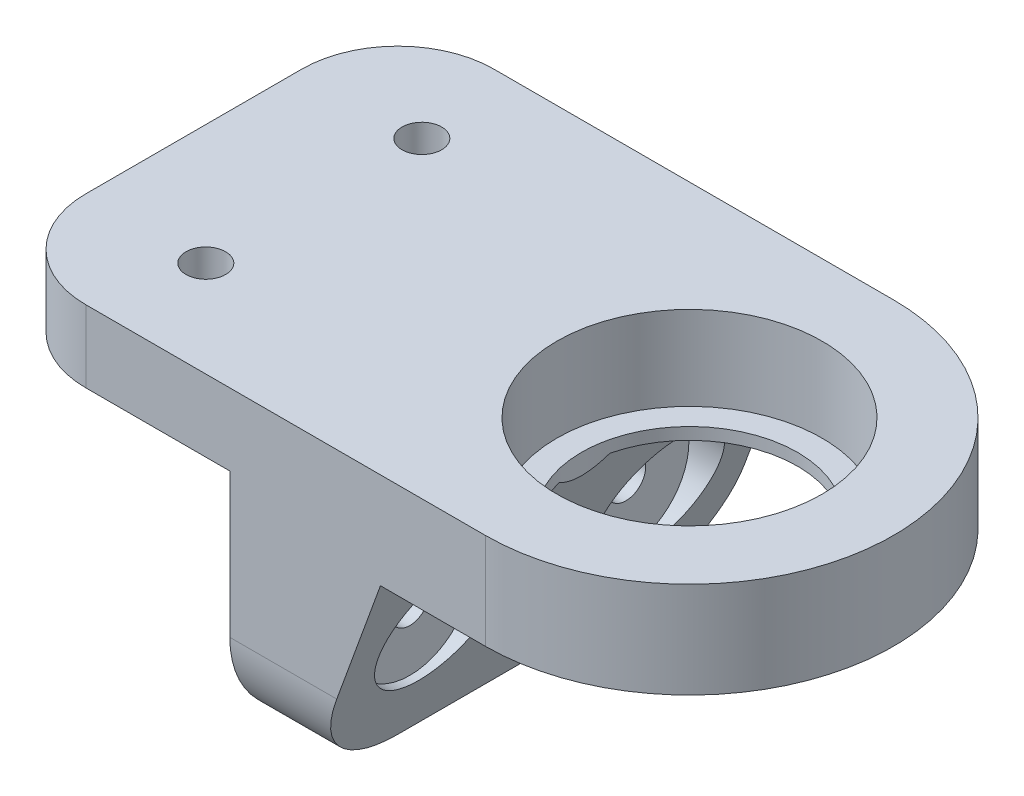
ISO-10303-21;
HEADER;
FILE_DESCRIPTION(('STEP AP214'),'2;1');
FILE_NAME('part.step','',(''),(''),'','','');
FILE_SCHEMA(('AUTOMOTIVE_DESIGN { 1 0 10303 214 1 1 1 1 }'));
ENDSEC;
DATA;
#1=APPLICATION_CONTEXT('core data for automotive mechanical design processes');
#2=APPLICATION_PROTOCOL_DEFINITION('international standard','automotive_design',2000,#1);
#3=PRODUCT_CONTEXT('',#1,'mechanical');
#4=PRODUCT('Part','Part','',(#3));
#5=PRODUCT_RELATED_PRODUCT_CATEGORY('part','',(#4));
#6=PRODUCT_DEFINITION_FORMATION('','',#4);
#7=PRODUCT_DEFINITION_CONTEXT('part definition',#1,'design');
#8=PRODUCT_DEFINITION('design','',#6,#7);
#9=PRODUCT_DEFINITION_SHAPE('','',#8);
#10=(LENGTH_UNIT() NAMED_UNIT(*) SI_UNIT(.MILLI.,.METRE.));
#11=(NAMED_UNIT(*) PLANE_ANGLE_UNIT() SI_UNIT($,.RADIAN.));
#12=(NAMED_UNIT(*) SI_UNIT($,.STERADIAN.) SOLID_ANGLE_UNIT());
#13=UNCERTAINTY_MEASURE_WITH_UNIT(LENGTH_MEASURE(1.E-05),#10,'distance_accuracy_value','');
#14=(GEOMETRIC_REPRESENTATION_CONTEXT(3) GLOBAL_UNCERTAINTY_ASSIGNED_CONTEXT((#13)) GLOBAL_UNIT_ASSIGNED_CONTEXT((#10,
#11,#12)) REPRESENTATION_CONTEXT('',''));
#15=CARTESIAN_POINT('',(0.,0.,0.));
#16=DIRECTION('',(0.,0.,1.));
#17=DIRECTION('',(1.,0.,0.));
#18=AXIS2_PLACEMENT_3D('',#15,#16,#17);
#19=CARTESIAN_POINT('',(-10.,26.,29.));
#20=DIRECTION('',(0.,-1.,0.));
#21=DIRECTION('',(0.,0.,-1.));
#22=AXIS2_PLACEMENT_3D('',#19,#20,#21);
#23=CYLINDRICAL_SURFACE('',#22,1.65);
#24=CARTESIAN_POINT('',(-10.,26.,29.));
#25=DIRECTION('',(0.,-1.,0.));
#26=DIRECTION('',(0.,0.,1.));
#27=AXIS2_PLACEMENT_3D('',#24,#25,#26);
#28=CIRCLE('',#27,1.65);
#29=CARTESIAN_POINT('',(-10.,26.,30.65));
#30=VERTEX_POINT('',#29);
#31=EDGE_CURVE('E210',#30,#30,#28,.T.);
#32=ORIENTED_EDGE('',*,*,#31,.F.);
#33=EDGE_LOOP('',(#32));
#34=FACE_BOUND('',#33,.T.);
#35=CARTESIAN_POINT('',(-10.,21.,29.));
#36=DIRECTION('',(0.,-1.,0.));
#37=DIRECTION('',(0.,0.,-1.));
#38=AXIS2_PLACEMENT_3D('',#35,#36,#37);
#39=CIRCLE('',#38,1.65);
#40=CARTESIAN_POINT('',(-10.,21.,27.35));
#41=VERTEX_POINT('',#40);
#42=EDGE_CURVE('E260',#41,#41,#39,.F.);
#43=ORIENTED_EDGE('',*,*,#42,.F.);
#44=EDGE_LOOP('',(#43));
#45=FACE_BOUND('',#44,.T.);
#46=ADVANCED_FACE('F36',(#34,#45),#23,.F.);
#47=CARTESIAN_POINT('',(-10.,26.,11.));
#48=DIRECTION('',(0.,-1.,0.));
#49=DIRECTION('',(0.,0.,-1.));
#50=AXIS2_PLACEMENT_3D('',#47,#48,#49);
#51=CYLINDRICAL_SURFACE('',#50,1.65);
#52=CARTESIAN_POINT('',(-10.,26.,11.));
#53=DIRECTION('',(0.,-1.,0.));
#54=DIRECTION('',(0.,0.,-1.));
#55=AXIS2_PLACEMENT_3D('',#52,#53,#54);
#56=CIRCLE('',#55,1.65);
#57=CARTESIAN_POINT('',(-10.,26.,9.35));
#58=VERTEX_POINT('',#57);
#59=EDGE_CURVE('E144',#58,#58,#56,.T.);
#60=ORIENTED_EDGE('',*,*,#59,.F.);
#61=EDGE_LOOP('',(#60));
#62=FACE_BOUND('',#61,.T.);
#63=CARTESIAN_POINT('',(-10.,21.,11.));
#64=DIRECTION('',(0.,-1.,0.));
#65=DIRECTION('',(0.,0.,-1.));
#66=AXIS2_PLACEMENT_3D('',#63,#64,#65);
#67=CIRCLE('',#66,1.65);
#68=CARTESIAN_POINT('',(-10.,21.,9.35));
#69=VERTEX_POINT('',#68);
#70=EDGE_CURVE('E256',#69,#69,#67,.F.);
#71=ORIENTED_EDGE('',*,*,#70,.F.);
#72=EDGE_LOOP('',(#71));
#73=FACE_BOUND('',#72,.T.);
#74=ADVANCED_FACE('F305',(#62,#73),#51,.F.);
#75=CARTESIAN_POINT('',(38.3,10.,11.));
#76=DIRECTION('',(-1.,0.,0.));
#77=DIRECTION('',(0.,-1.,0.));
#78=AXIS2_PLACEMENT_3D('',#75,#76,#77);
#79=CYLINDRICAL_SURFACE('',#78,1.65);
#80=CARTESIAN_POINT('',(1.,10.,11.));
#81=DIRECTION('',(1.,0.,0.));
#82=DIRECTION('',(0.,0.,-1.));
#83=AXIS2_PLACEMENT_3D('',#80,#81,#82);
#84=CIRCLE('',#83,1.65);
#85=CARTESIAN_POINT('',(1.,10.,9.35));
#86=VERTEX_POINT('',#85);
#87=EDGE_CURVE('E40',#86,#86,#84,.F.);
#88=ORIENTED_EDGE('',*,*,#87,.T.);
#89=EDGE_LOOP('',(#88));
#90=FACE_BOUND('',#89,.T.);
#91=CARTESIAN_POINT('',(7.,10.,11.));
#92=DIRECTION('',(1.,0.,0.));
#93=DIRECTION('',(0.,0.,-1.));
#94=AXIS2_PLACEMENT_3D('',#91,#92,#93);
#95=CIRCLE('',#94,1.65);
#96=CARTESIAN_POINT('',(7.,10.,9.35));
#97=VERTEX_POINT('',#96);
#98=EDGE_CURVE('E220',#97,#97,#95,.F.);
#99=ORIENTED_EDGE('',*,*,#98,.F.);
#100=EDGE_LOOP('',(#99));
#101=FACE_BOUND('',#100,.T.);
#102=ADVANCED_FACE('F357',(#90,#101),#79,.F.);
#103=CARTESIAN_POINT('',(38.3,10.,29.));
#104=DIRECTION('',(-1.,0.,0.));
#105=DIRECTION('',(0.,-1.,0.));
#106=AXIS2_PLACEMENT_3D('',#103,#104,#105);
#107=CYLINDRICAL_SURFACE('',#106,1.65);
#108=CARTESIAN_POINT('',(1.,10.,29.));
#109=DIRECTION('',(1.,0.,0.));
#110=DIRECTION('',(0.,0.,-1.));
#111=AXIS2_PLACEMENT_3D('',#108,#109,#110);
#112=CIRCLE('',#111,1.65);
#113=CARTESIAN_POINT('',(1.,10.,27.35));
#114=VERTEX_POINT('',#113);
#115=EDGE_CURVE('E264',#114,#114,#112,.F.);
#116=ORIENTED_EDGE('',*,*,#115,.T.);
#117=EDGE_LOOP('',(#116));
#118=FACE_BOUND('',#117,.T.);
#119=CARTESIAN_POINT('',(7.,10.,29.));
#120=DIRECTION('',(1.,0.,0.));
#121=DIRECTION('',(0.,0.,-1.));
#122=AXIS2_PLACEMENT_3D('',#119,#120,#121);
#123=CIRCLE('',#122,1.65);
#124=CARTESIAN_POINT('',(7.,10.,27.35));
#125=VERTEX_POINT('',#124);
#126=EDGE_CURVE('E212',#125,#125,#123,.F.);
#127=ORIENTED_EDGE('',*,*,#126,.F.);
#128=EDGE_LOOP('',(#127));
#129=FACE_BOUND('',#128,.T.);
#130=ADVANCED_FACE('F360',(#118,#129),#107,.F.);
#131=CARTESIAN_POINT('',(21.3,26.,20.));
#132=DIRECTION('',(0.,-1.,0.));
#133=DIRECTION('',(0.,0.,-1.));
#134=AXIS2_PLACEMENT_3D('',#131,#132,#133);
#135=CYLINDRICAL_SURFACE('',#134,9.00000000000001);
#136=CARTESIAN_POINT('',(21.3,18.,20.));
#137=DIRECTION('',(0.,1.,0.));
#138=DIRECTION('',(0.,0.,1.));
#139=AXIS2_PLACEMENT_3D('',#136,#137,#138);
#140=CIRCLE('',#139,9.00000000000001);
#141=CARTESIAN_POINT('',(12.5514642167915,18.,22.1126101509557));
#142=VERTEX_POINT('',#141);
#143=CARTESIAN_POINT('',(12.5514642167915,18.,17.8873898490444));
#144=VERTEX_POINT('',#143);
#145=EDGE_CURVE('E179',#142,#144,#140,.T.);
#146=ORIENTED_EDGE('',*,*,#145,.F.);
#147=CARTESIAN_POINT('',(21.3,42.0364045176566,20.));
#148=DIRECTION('',(-0.939692620785911,0.342020143325663,0.));
#149=DIRECTION('',(-0.342020143325663,-0.939692620785911,0.));
#150=AXIS2_PLACEMENT_3D('',#147,#148,#149);
#151=ELLIPSE('',#150,26.3142396014683,9.00000000000001);
#152=EDGE_CURVE('E182',#144,#142,#151,.T.);
#153=ORIENTED_EDGE('',*,*,#152,.F.);
#154=EDGE_LOOP('',(#146,#153));
#155=FACE_BOUND('',#154,.T.);
#156=CARTESIAN_POINT('',(21.3,19.,20.));
#157=DIRECTION('',(0.,1.,0.));
#158=DIRECTION('',(-1.,0.,0.));
#159=AXIS2_PLACEMENT_3D('',#156,#157,#158);
#160=CIRCLE('',#159,9.00000000000001);
#161=CARTESIAN_POINT('',(12.3,19.,20.));
#162=VERTEX_POINT('',#161);
#163=EDGE_CURVE('E207',#162,#162,#160,.F.);
#164=ORIENTED_EDGE('',*,*,#163,.F.);
#165=EDGE_LOOP('',(#164));
#166=FACE_BOUND('',#165,.T.);
#167=ADVANCED_FACE('F364',(#155,#166),#135,.F.);
#168=CARTESIAN_POINT('',(0.,20.,40.));
#169=DIRECTION('',(1.,0.,0.));
#170=DIRECTION('',(0.,1.,0.));
#171=AXIS2_PLACEMENT_3D('',#168,#169,#170);
#172=PLANE('',#171);
#173=CARTESIAN_POINT('',(0.,10.,11.));
#174=DIRECTION('',(1.,0.,0.));
#175=DIRECTION('',(0.,0.,-1.));
#176=AXIS2_PLACEMENT_3D('',#173,#174,#175);
#177=CIRCLE('',#176,5.25);
#178=CARTESIAN_POINT('',(0.,10.,5.75000000000001));
#179=VERTEX_POINT('',#178);
#180=EDGE_CURVE('E280',#179,#179,#177,.T.);
#181=ORIENTED_EDGE('',*,*,#180,.T.);
#182=EDGE_LOOP('',(#181));
#183=FACE_BOUND('',#182,.T.);
#184=CARTESIAN_POINT('',(0.,10.,29.));
#185=DIRECTION('',(1.,0.,0.));
#186=DIRECTION('',(0.,0.,-1.));
#187=AXIS2_PLACEMENT_3D('',#184,#185,#186);
#188=CIRCLE('',#187,5.25);
#189=CARTESIAN_POINT('',(0.,10.,23.75));
#190=VERTEX_POINT('',#189);
#191=EDGE_CURVE('E273',#190,#190,#188,.T.);
#192=ORIENTED_EDGE('',*,*,#191,.T.);
#193=EDGE_LOOP('',(#192));
#194=FACE_BOUND('',#193,.T.);
#195=DIRECTION('',(0.,-1.,0.));
#196=VECTOR('',#195,1.);
#197=CARTESIAN_POINT('',(0.,20.,2.99999999999999));
#198=LINE('',#197,#196);
#199=CARTESIAN_POINT('',(0.,20.,2.99999999999999));
#200=VERTEX_POINT('',#199);
#201=CARTESIAN_POINT('',(0.,8.,2.99999999999999));
#202=VERTEX_POINT('',#201);
#203=EDGE_CURVE('E169',#200,#202,#198,.T.);
#204=ORIENTED_EDGE('',*,*,#203,.T.);
#205=CARTESIAN_POINT('',(0.,8.,11.));
#206=DIRECTION('',(1.,0.,0.));
#207=DIRECTION('',(0.,1.,0.));
#208=AXIS2_PLACEMENT_3D('',#205,#206,#207);
#209=CIRCLE('',#208,8.);
#210=CARTESIAN_POINT('',(0.,0.,11.));
#211=VERTEX_POINT('',#210);
#212=EDGE_CURVE('E250',#202,#211,#209,.F.);
#213=ORIENTED_EDGE('',*,*,#212,.T.);
#214=DIRECTION('',(0.,0.,-1.));
#215=VECTOR('',#214,1.);
#216=CARTESIAN_POINT('',(0.,0.,40.));
#217=LINE('',#216,#215);
#218=CARTESIAN_POINT('',(0.,0.,29.));
#219=VERTEX_POINT('',#218);
#220=EDGE_CURVE('E199',#219,#211,#217,.T.);
#221=ORIENTED_EDGE('',*,*,#220,.F.);
#222=CARTESIAN_POINT('',(0.,8.,29.));
#223=DIRECTION('',(1.,0.,0.));
#224=DIRECTION('',(0.,1.,0.));
#225=AXIS2_PLACEMENT_3D('',#222,#223,#224);
#226=CIRCLE('',#225,8.);
#227=CARTESIAN_POINT('',(0.,8.,37.));
#228=VERTEX_POINT('',#227);
#229=EDGE_CURVE('E248',#219,#228,#226,.F.);
#230=ORIENTED_EDGE('',*,*,#229,.T.);
#231=DIRECTION('',(0.,1.,0.));
#232=VECTOR('',#231,1.);
#233=CARTESIAN_POINT('',(0.,20.,37.));
#234=LINE('',#233,#232);
#235=CARTESIAN_POINT('',(0.,20.,37.));
#236=VERTEX_POINT('',#235);
#237=EDGE_CURVE('E163',#228,#236,#234,.T.);
#238=ORIENTED_EDGE('',*,*,#237,.T.);
#239=DIRECTION('',(0.,0.,-1.));
#240=VECTOR('',#239,1.);
#241=CARTESIAN_POINT('',(0.,20.,40.));
#242=LINE('',#241,#240);
#243=EDGE_CURVE('E185',#236,#200,#242,.T.);
#244=ORIENTED_EDGE('',*,*,#243,.T.);
#245=EDGE_LOOP('',(#204,#213,#221,#230,#238,#244));
#246=FACE_BOUND('',#245,.T.);
#247=ADVANCED_FACE('F379',(#183,#194,#246),#172,.F.);
#248=CARTESIAN_POINT('',(0.,0.,40.));
#249=DIRECTION('',(0.,1.,0.));
#250=DIRECTION('',(0.,0.,1.));
#251=AXIS2_PLACEMENT_3D('',#248,#249,#250);
#252=PLANE('',#251);
#253=ORIENTED_EDGE('',*,*,#220,.T.);
#254=DIRECTION('',(-1.,0.,0.));
#255=VECTOR('',#254,1.);
#256=CARTESIAN_POINT('',(0.,0.,11.));
#257=LINE('',#256,#255);
#258=CARTESIAN_POINT('',(6.,0.,11.));
#259=VERTEX_POINT('',#258);
#260=EDGE_CURVE('E53',#211,#259,#257,.F.);
#261=ORIENTED_EDGE('',*,*,#260,.T.);
#262=DIRECTION('',(0.,0.,-1.));
#263=VECTOR('',#262,1.);
#264=CARTESIAN_POINT('',(6.,0.,40.));
#265=LINE('',#264,#263);
#266=CARTESIAN_POINT('',(6.,0.,29.));
#267=VERTEX_POINT('',#266);
#268=EDGE_CURVE('E197',#267,#259,#265,.T.);
#269=ORIENTED_EDGE('',*,*,#268,.F.);
#270=DIRECTION('',(1.,0.,0.));
#271=VECTOR('',#270,1.);
#272=CARTESIAN_POINT('',(0.,0.,29.));
#273=LINE('',#272,#271);
#274=EDGE_CURVE('E252',#267,#219,#273,.F.);
#275=ORIENTED_EDGE('',*,*,#274,.T.);
#276=EDGE_LOOP('',(#253,#261,#269,#275));
#277=FACE_BOUND('',#276,.T.);
#278=ADVANCED_FACE('F398',(#277),#252,.F.);
#279=CARTESIAN_POINT('',(6.,0.,40.));
#280=DIRECTION('',(-0.939692620785911,0.342020143325663,0.));
#281=DIRECTION('',(-0.342020143325663,-0.939692620785911,0.));
#282=AXIS2_PLACEMENT_3D('',#279,#280,#281);
#283=PLANE('',#282);
#284=CARTESIAN_POINT('',(9.63970234266195,10.,11.));
#285=DIRECTION('',(-0.939692620785911,0.342020143325663,0.));
#286=DIRECTION('',(-0.342020143325663,-0.939692620785911,0.));
#287=AXIS2_PLACEMENT_3D('',#284,#285,#286);
#288=ELLIPSE('',#287,5.58693330549853,5.25);
#289=CARTESIAN_POINT('',(7.72885861276443,4.75,11.));
#290=VERTEX_POINT('',#289);
#291=EDGE_CURVE('E223',#290,#290,#288,.F.);
#292=ORIENTED_EDGE('',*,*,#291,.F.);
#293=EDGE_LOOP('',(#292));
#294=FACE_BOUND('',#293,.T.);
#295=CARTESIAN_POINT('',(9.63970234266195,10.,29.));
#296=DIRECTION('',(-0.939692620785911,0.342020143325663,0.));
#297=DIRECTION('',(-0.342020143325663,-0.939692620785911,0.));
#298=AXIS2_PLACEMENT_3D('',#295,#296,#297);
#299=ELLIPSE('',#298,5.58693330549853,5.25);
#300=CARTESIAN_POINT('',(7.72885861276443,4.75,29.));
#301=VERTEX_POINT('',#300);
#302=EDGE_CURVE('E215',#301,#301,#299,.F.);
#303=ORIENTED_EDGE('',*,*,#302,.F.);
#304=EDGE_LOOP('',(#303));
#305=FACE_BOUND('',#304,.T.);
#306=ORIENTED_EDGE('',*,*,#268,.T.);
#307=CARTESIAN_POINT('',(8.91176187412956,8.,11.));
#308=DIRECTION('',(-0.939692620785911,0.342020143325663,0.));
#309=DIRECTION('',(-0.342020143325663,-0.939692620785911,0.));
#310=AXIS2_PLACEMENT_3D('',#307,#308,#309);
#311=ELLIPSE('',#310,8.51342217980728,8.);
#312=CARTESIAN_POINT('',(8.91176187412956,8.,3.));
#313=VERTEX_POINT('',#312);
#314=EDGE_CURVE('E11',#259,#313,#311,.F.);
#315=ORIENTED_EDGE('',*,*,#314,.T.);
#316=DIRECTION('',(0.342020143325663,0.939692620785911,0.));
#317=VECTOR('',#316,1.);
#318=CARTESIAN_POINT('',(6.,0.,3.));
#319=LINE('',#318,#317);
#320=CARTESIAN_POINT('',(12.5514642167915,18.,3.));
#321=VERTEX_POINT('',#320);
#322=EDGE_CURVE('E175',#313,#321,#319,.T.);
#323=ORIENTED_EDGE('',*,*,#322,.T.);
#324=DIRECTION('',(0.,0.,-1.));
#325=VECTOR('',#324,1.);
#326=CARTESIAN_POINT('',(12.5514642167915,18.,40.));
#327=LINE('',#326,#325);
#328=EDGE_CURVE('E194',#144,#321,#327,.T.);
#329=ORIENTED_EDGE('',*,*,#328,.F.);
#330=ORIENTED_EDGE('',*,*,#152,.T.);
#331=CARTESIAN_POINT('',(12.5514642167915,18.,37.));
#332=VERTEX_POINT('',#331);
#333=EDGE_CURVE('E195',#332,#142,#327,.T.);
#334=ORIENTED_EDGE('',*,*,#333,.F.);
#335=DIRECTION('',(-0.342020143325663,-0.939692620785911,0.));
#336=VECTOR('',#335,1.);
#337=CARTESIAN_POINT('',(6.,0.,37.));
#338=LINE('',#337,#336);
#339=CARTESIAN_POINT('',(8.91176187412956,8.,37.));
#340=VERTEX_POINT('',#339);
#341=EDGE_CURVE('E167',#332,#340,#338,.T.);
#342=ORIENTED_EDGE('',*,*,#341,.T.);
#343=CARTESIAN_POINT('',(8.91176187412956,8.,29.));
#344=DIRECTION('',(-0.939692620785911,0.342020143325663,0.));
#345=DIRECTION('',(0.342020143325663,0.939692620785911,0.));
#346=AXIS2_PLACEMENT_3D('',#343,#344,#345);
#347=ELLIPSE('',#346,8.51342217980728,8.);
#348=EDGE_CURVE('E45',#340,#267,#347,.F.);
#349=ORIENTED_EDGE('',*,*,#348,.T.);
#350=EDGE_LOOP('',(#306,#315,#323,#329,#330,#334,#342,#349));
#351=FACE_BOUND('',#350,.T.);
#352=ADVANCED_FACE('F394',(#294,#305,#351),#283,.F.);
#353=CARTESIAN_POINT('',(12.5514642167915,18.,40.));
#354=DIRECTION('',(0.,1.,0.));
#355=DIRECTION('',(0.,0.,1.));
#356=AXIS2_PLACEMENT_3D('',#353,#354,#355);
#357=PLANE('',#356);
#358=ORIENTED_EDGE('',*,*,#328,.T.);
#359=DIRECTION('',(1.,0.,0.));
#360=VECTOR('',#359,1.);
#361=CARTESIAN_POINT('',(12.5514642167915,18.,3.));
#362=LINE('',#361,#360);
#363=CARTESIAN_POINT('',(21.3,18.,3.));
#364=VERTEX_POINT('',#363);
#365=EDGE_CURVE('E172',#321,#364,#362,.T.);
#366=ORIENTED_EDGE('',*,*,#365,.T.);
#367=CARTESIAN_POINT('',(21.3,18.,20.));
#368=DIRECTION('',(0.,1.,0.));
#369=DIRECTION('',(0.,0.,1.));
#370=AXIS2_PLACEMENT_3D('',#367,#368,#369);
#371=CIRCLE('',#370,17.);
#372=CARTESIAN_POINT('',(21.3,18.,37.));
#373=VERTEX_POINT('',#372);
#374=EDGE_CURVE('E177',#364,#373,#371,.F.);
#375=ORIENTED_EDGE('',*,*,#374,.T.);
#376=DIRECTION('',(-1.,0.,0.));
#377=VECTOR('',#376,1.);
#378=CARTESIAN_POINT('',(12.5514642167915,18.,37.));
#379=LINE('',#378,#377);
#380=EDGE_CURVE('E150',#373,#332,#379,.T.);
#381=ORIENTED_EDGE('',*,*,#380,.T.);
#382=ORIENTED_EDGE('',*,*,#333,.T.);
#383=ORIENTED_EDGE('',*,*,#145,.T.);
#384=EDGE_LOOP('',(#358,#366,#375,#381,#382,#383));
#385=FACE_BOUND('',#384,.T.);
#386=ADVANCED_FACE('F390',(#385),#357,.F.);
#387=CARTESIAN_POINT('',(49.,26.,40.));
#388=DIRECTION('',(0.,-1.,0.));
#389=DIRECTION('',(1.,0.,0.));
#390=AXIS2_PLACEMENT_3D('',#387,#388,#389);
#391=PLANE('',#390);
#392=CARTESIAN_POINT('',(21.3,26.,20.));
#393=DIRECTION('',(0.,1.,0.));
#394=DIRECTION('',(-1.,0.,0.));
#395=AXIS2_PLACEMENT_3D('',#392,#393,#394);
#396=CIRCLE('',#395,11.05);
#397=CARTESIAN_POINT('',(10.25,26.,20.));
#398=VERTEX_POINT('',#397);
#399=EDGE_CURVE('E219',#398,#398,#396,.T.);
#400=ORIENTED_EDGE('',*,*,#399,.F.);
#401=EDGE_LOOP('',(#400));
#402=FACE_BOUND('',#401,.T.);
#403=ORIENTED_EDGE('',*,*,#31,.T.);
#404=EDGE_LOOP('',(#403));
#405=FACE_BOUND('',#404,.T.);
#406=ORIENTED_EDGE('',*,*,#59,.T.);
#407=EDGE_LOOP('',(#406));
#408=FACE_BOUND('',#407,.T.);
#409=DIRECTION('',(0.,0.,-1.));
#410=VECTOR('',#409,1.);
#411=CARTESIAN_POINT('',(-20.,26.,40.));
#412=LINE('',#411,#410);
#413=CARTESIAN_POINT('',(-20.,26.,29.));
#414=VERTEX_POINT('',#413);
#415=CARTESIAN_POINT('',(-20.,26.,11.));
#416=VERTEX_POINT('',#415);
#417=EDGE_CURVE('E191',#414,#416,#412,.T.);
#418=ORIENTED_EDGE('',*,*,#417,.F.);
#419=CARTESIAN_POINT('',(-12.,26.,29.));
#420=DIRECTION('',(0.,-1.,0.));
#421=DIRECTION('',(1.,0.,0.));
#422=AXIS2_PLACEMENT_3D('',#419,#420,#421);
#423=CIRCLE('',#422,8.);
#424=CARTESIAN_POINT('',(-12.,26.,37.));
#425=VERTEX_POINT('',#424);
#426=EDGE_CURVE('E140',#414,#425,#423,.F.);
#427=ORIENTED_EDGE('',*,*,#426,.T.);
#428=DIRECTION('',(1.,0.,0.));
#429=VECTOR('',#428,1.);
#430=CARTESIAN_POINT('',(-20.,26.,37.));
#431=LINE('',#430,#429);
#432=CARTESIAN_POINT('',(21.3,26.,37.));
#433=VERTEX_POINT('',#432);
#434=EDGE_CURVE('E132',#425,#433,#431,.T.);
#435=ORIENTED_EDGE('',*,*,#434,.T.);
#436=CARTESIAN_POINT('',(21.3,26.,20.));
#437=DIRECTION('',(0.,1.,0.));
#438=DIRECTION('',(0.,0.,-1.));
#439=AXIS2_PLACEMENT_3D('',#436,#437,#438);
#440=CIRCLE('',#439,17.);
#441=CARTESIAN_POINT('',(21.3,26.,3.));
#442=VERTEX_POINT('',#441);
#443=EDGE_CURVE('E138',#433,#442,#440,.T.);
#444=ORIENTED_EDGE('',*,*,#443,.T.);
#445=DIRECTION('',(-1.,0.,0.));
#446=VECTOR('',#445,1.);
#447=CARTESIAN_POINT('',(21.3,26.,3.));
#448=LINE('',#447,#446);
#449=CARTESIAN_POINT('',(-12.,26.,2.99999999999999));
#450=VERTEX_POINT('',#449);
#451=EDGE_CURVE('E154',#442,#450,#448,.T.);
#452=ORIENTED_EDGE('',*,*,#451,.T.);
#453=CARTESIAN_POINT('',(-12.,26.,11.));
#454=DIRECTION('',(0.,-1.,0.));
#455=DIRECTION('',(1.,0.,0.));
#456=AXIS2_PLACEMENT_3D('',#453,#454,#455);
#457=CIRCLE('',#456,8.);
#458=EDGE_CURVE('E240',#450,#416,#457,.F.);
#459=ORIENTED_EDGE('',*,*,#458,.T.);
#460=EDGE_LOOP('',(#418,#427,#435,#444,#452,#459));
#461=FACE_BOUND('',#460,.T.);
#462=ADVANCED_FACE('F135',(#402,#405,#408,#461),#391,.F.);
#463=CARTESIAN_POINT('',(-20.,26.,40.));
#464=DIRECTION('',(1.,0.,0.));
#465=DIRECTION('',(0.,1.,0.));
#466=AXIS2_PLACEMENT_3D('',#463,#464,#465);
#467=PLANE('',#466);
#468=DIRECTION('',(0.,0.,-1.));
#469=VECTOR('',#468,1.);
#470=CARTESIAN_POINT('',(-20.,20.,40.));
#471=LINE('',#470,#469);
#472=CARTESIAN_POINT('',(-20.,20.,29.));
#473=VERTEX_POINT('',#472);
#474=CARTESIAN_POINT('',(-20.,20.,11.));
#475=VERTEX_POINT('',#474);
#476=EDGE_CURVE('E188',#473,#475,#471,.T.);
#477=ORIENTED_EDGE('',*,*,#476,.F.);
#478=DIRECTION('',(0.,-1.,0.));
#479=VECTOR('',#478,1.);
#480=CARTESIAN_POINT('',(-20.,26.,29.));
#481=LINE('',#480,#479);
#482=EDGE_CURVE('E238',#473,#414,#481,.F.);
#483=ORIENTED_EDGE('',*,*,#482,.T.);
#484=ORIENTED_EDGE('',*,*,#417,.T.);
#485=DIRECTION('',(0.,-1.,0.));
#486=VECTOR('',#485,1.);
#487=CARTESIAN_POINT('',(-20.,26.,11.));
#488=LINE('',#487,#486);
#489=EDGE_CURVE('E235',#416,#475,#488,.T.);
#490=ORIENTED_EDGE('',*,*,#489,.T.);
#491=EDGE_LOOP('',(#477,#483,#484,#490));
#492=FACE_BOUND('',#491,.T.);
#493=ADVANCED_FACE('F383',(#492),#467,.F.);
#494=CARTESIAN_POINT('',(-20.,20.,40.));
#495=DIRECTION('',(0.,1.,0.));
#496=DIRECTION('',(0.,0.,1.));
#497=AXIS2_PLACEMENT_3D('',#494,#495,#496);
#498=PLANE('',#497);
#499=CARTESIAN_POINT('',(-10.,20.,29.));
#500=DIRECTION('',(0.,-1.,0.));
#501=DIRECTION('',(0.,0.,-1.));
#502=AXIS2_PLACEMENT_3D('',#499,#500,#501);
#503=CIRCLE('',#502,5.25);
#504=CARTESIAN_POINT('',(-10.,20.,23.75));
#505=VERTEX_POINT('',#504);
#506=EDGE_CURVE('E266',#505,#505,#503,.T.);
#507=ORIENTED_EDGE('',*,*,#506,.F.);
#508=EDGE_LOOP('',(#507));
#509=FACE_BOUND('',#508,.T.);
#510=CARTESIAN_POINT('',(-10.,20.,11.));
#511=DIRECTION('',(0.,-1.,0.));
#512=DIRECTION('',(0.,0.,-1.));
#513=AXIS2_PLACEMENT_3D('',#510,#511,#512);
#514=CIRCLE('',#513,5.25);
#515=CARTESIAN_POINT('',(-10.,20.,5.75));
#516=VERTEX_POINT('',#515);
#517=EDGE_CURVE('E262',#516,#516,#514,.T.);
#518=ORIENTED_EDGE('',*,*,#517,.F.);
#519=EDGE_LOOP('',(#518));
#520=FACE_BOUND('',#519,.T.);
#521=DIRECTION('',(-1.,0.,0.));
#522=VECTOR('',#521,1.);
#523=CARTESIAN_POINT('',(-20.,20.,37.));
#524=LINE('',#523,#522);
#525=CARTESIAN_POINT('',(-12.,20.,37.));
#526=VERTEX_POINT('',#525);
#527=EDGE_CURVE('E201',#236,#526,#524,.T.);
#528=ORIENTED_EDGE('',*,*,#527,.T.);
#529=CARTESIAN_POINT('',(-12.,20.,29.));
#530=DIRECTION('',(0.,1.,0.));
#531=DIRECTION('',(0.,0.,1.));
#532=AXIS2_PLACEMENT_3D('',#529,#530,#531);
#533=CIRCLE('',#532,8.);
#534=EDGE_CURVE('E233',#526,#473,#533,.F.);
#535=ORIENTED_EDGE('',*,*,#534,.T.);
#536=ORIENTED_EDGE('',*,*,#476,.T.);
#537=CARTESIAN_POINT('',(-12.,20.,11.));
#538=DIRECTION('',(0.,1.,0.));
#539=DIRECTION('',(0.,0.,1.));
#540=AXIS2_PLACEMENT_3D('',#537,#538,#539);
#541=CIRCLE('',#540,8.);
#542=CARTESIAN_POINT('',(-12.,20.,2.99999999999999));
#543=VERTEX_POINT('',#542);
#544=EDGE_CURVE('E231',#475,#543,#541,.F.);
#545=ORIENTED_EDGE('',*,*,#544,.T.);
#546=DIRECTION('',(1.,0.,0.));
#547=VECTOR('',#546,1.);
#548=CARTESIAN_POINT('',(-20.,20.,2.99999999999999));
#549=LINE('',#548,#547);
#550=EDGE_CURVE('E204',#543,#200,#549,.T.);
#551=ORIENTED_EDGE('',*,*,#550,.T.);
#552=ORIENTED_EDGE('',*,*,#243,.F.);
#553=EDGE_LOOP('',(#528,#535,#536,#545,#551,#552));
#554=FACE_BOUND('',#553,.T.);
#555=ADVANCED_FACE('F374',(#509,#520,#554),#498,.F.);
#556=CARTESIAN_POINT('',(21.3,26.,20.));
#557=DIRECTION('',(0.,-1.,0.));
#558=DIRECTION('',(0.,0.,-1.));
#559=AXIS2_PLACEMENT_3D('',#556,#557,#558);
#560=CYLINDRICAL_SURFACE('',#559,17.);
#561=DIRECTION('',(0.,-1.,0.));
#562=VECTOR('',#561,1.);
#563=CARTESIAN_POINT('',(21.3,26.,3.));
#564=LINE('',#563,#562);
#565=EDGE_CURVE('E153',#442,#364,#564,.T.);
#566=ORIENTED_EDGE('',*,*,#565,.F.);
#567=ORIENTED_EDGE('',*,*,#443,.F.);
#568=DIRECTION('',(0.,-1.,0.));
#569=VECTOR('',#568,1.);
#570=CARTESIAN_POINT('',(21.3,26.,37.));
#571=LINE('',#570,#569);
#572=EDGE_CURVE('E147',#433,#373,#571,.T.);
#573=ORIENTED_EDGE('',*,*,#572,.T.);
#574=ORIENTED_EDGE('',*,*,#374,.F.);
#575=EDGE_LOOP('',(#566,#567,#573,#574));
#576=FACE_BOUND('',#575,.T.);
#577=ADVANCED_FACE('F156',(#576),#560,.T.);
#578=CARTESIAN_POINT('',(21.3,26.,3.));
#579=DIRECTION('',(0.,0.,1.));
#580=DIRECTION('',(1.,0.,0.));
#581=AXIS2_PLACEMENT_3D('',#578,#579,#580);
#582=PLANE('',#581);
#583=ORIENTED_EDGE('',*,*,#550,.F.);
#584=DIRECTION('',(0.,-1.,0.));
#585=VECTOR('',#584,1.);
#586=CARTESIAN_POINT('',(-12.,26.,2.99999999999999));
#587=LINE('',#586,#585);
#588=EDGE_CURVE('E246',#543,#450,#587,.F.);
#589=ORIENTED_EDGE('',*,*,#588,.T.);
#590=ORIENTED_EDGE('',*,*,#451,.F.);
#591=ORIENTED_EDGE('',*,*,#565,.T.);
#592=ORIENTED_EDGE('',*,*,#365,.F.);
#593=ORIENTED_EDGE('',*,*,#322,.F.);
#594=DIRECTION('',(-1.,0.,0.));
#595=VECTOR('',#594,1.);
#596=CARTESIAN_POINT('',(21.3,8.,3.));
#597=LINE('',#596,#595);
#598=EDGE_CURVE('E243',#313,#202,#597,.T.);
#599=ORIENTED_EDGE('',*,*,#598,.T.);
#600=ORIENTED_EDGE('',*,*,#203,.F.);
#601=EDGE_LOOP('',(#583,#589,#590,#591,#592,#593,#599,#600));
#602=FACE_BOUND('',#601,.T.);
#603=ADVANCED_FACE('F368',(#602),#582,.F.);
#604=CARTESIAN_POINT('',(-20.,26.,37.));
#605=DIRECTION('',(0.,0.,-1.));
#606=DIRECTION('',(-1.,0.,0.));
#607=AXIS2_PLACEMENT_3D('',#604,#605,#606);
#608=PLANE('',#607);
#609=ORIENTED_EDGE('',*,*,#434,.F.);
#610=DIRECTION('',(0.,-1.,0.));
#611=VECTOR('',#610,1.);
#612=CARTESIAN_POINT('',(-12.,26.,37.));
#613=LINE('',#612,#611);
#614=EDGE_CURVE('E229',#425,#526,#613,.T.);
#615=ORIENTED_EDGE('',*,*,#614,.T.);
#616=ORIENTED_EDGE('',*,*,#527,.F.);
#617=ORIENTED_EDGE('',*,*,#237,.F.);
#618=DIRECTION('',(1.,0.,0.));
#619=VECTOR('',#618,1.);
#620=CARTESIAN_POINT('',(-20.,8.,37.));
#621=LINE('',#620,#619);
#622=EDGE_CURVE('E206',#228,#340,#621,.T.);
#623=ORIENTED_EDGE('',*,*,#622,.T.);
#624=ORIENTED_EDGE('',*,*,#341,.F.);
#625=ORIENTED_EDGE('',*,*,#380,.F.);
#626=ORIENTED_EDGE('',*,*,#572,.F.);
#627=EDGE_LOOP('',(#609,#615,#616,#617,#623,#624,#625,#626));
#628=FACE_BOUND('',#627,.T.);
#629=ADVANCED_FACE('F148',(#628),#608,.F.);
#630=CARTESIAN_POINT('',(21.3,19.,20.));
#631=DIRECTION('',(0.,1.,0.));
#632=DIRECTION('',(-1.,0.,0.));
#633=AXIS2_PLACEMENT_3D('',#630,#631,#632);
#634=PLANE('',#633);
#635=CARTESIAN_POINT('',(21.3,19.,20.));
#636=DIRECTION('',(0.,1.,0.));
#637=DIRECTION('',(-1.,0.,0.));
#638=AXIS2_PLACEMENT_3D('',#635,#636,#637);
#639=CIRCLE('',#638,11.05);
#640=CARTESIAN_POINT('',(10.25,19.,20.));
#641=VERTEX_POINT('',#640);
#642=EDGE_CURVE('E211',#641,#641,#639,.T.);
#643=ORIENTED_EDGE('',*,*,#642,.T.);
#644=EDGE_LOOP('',(#643));
#645=FACE_BOUND('',#644,.T.);
#646=ORIENTED_EDGE('',*,*,#163,.T.);
#647=EDGE_LOOP('',(#646));
#648=FACE_BOUND('',#647,.T.);
#649=ADVANCED_FACE('F350',(#645,#648),#634,.T.);
#650=CARTESIAN_POINT('',(21.3,19.,20.));
#651=DIRECTION('',(0.,1.,0.));
#652=DIRECTION('',(-1.,0.,0.));
#653=AXIS2_PLACEMENT_3D('',#650,#651,#652);
#654=CYLINDRICAL_SURFACE('',#653,11.05);
#655=ORIENTED_EDGE('',*,*,#642,.F.);
#656=EDGE_LOOP('',(#655));
#657=FACE_BOUND('',#656,.T.);
#658=ORIENTED_EDGE('',*,*,#399,.T.);
#659=EDGE_LOOP('',(#658));
#660=FACE_BOUND('',#659,.T.);
#661=ADVANCED_FACE('F348',(#657,#660),#654,.F.);
#662=CARTESIAN_POINT('',(17.,10.,29.));
#663=DIRECTION('',(-1.,0.,0.));
#664=DIRECTION('',(0.,0.,1.));
#665=AXIS2_PLACEMENT_3D('',#662,#663,#664);
#666=CYLINDRICAL_SURFACE('',#665,5.25);
#667=CARTESIAN_POINT('',(7.,10.,29.));
#668=DIRECTION('',(1.,0.,0.));
#669=DIRECTION('',(0.,0.,-1.));
#670=AXIS2_PLACEMENT_3D('',#667,#668,#669);
#671=CIRCLE('',#670,5.25);
#672=CARTESIAN_POINT('',(7.,10.,23.75));
#673=VERTEX_POINT('',#672);
#674=EDGE_CURVE('E216',#673,#673,#671,.T.);
#675=ORIENTED_EDGE('',*,*,#674,.F.);
#676=EDGE_LOOP('',(#675));
#677=FACE_BOUND('',#676,.T.);
#678=ORIENTED_EDGE('',*,*,#302,.T.);
#679=EDGE_LOOP('',(#678));
#680=FACE_BOUND('',#679,.T.);
#681=ADVANCED_FACE('F344',(#677,#680),#666,.F.);
#682=CARTESIAN_POINT('',(7.,10.,29.));
#683=DIRECTION('',(1.,0.,0.));
#684=DIRECTION('',(0.,0.,-1.));
#685=AXIS2_PLACEMENT_3D('',#682,#683,#684);
#686=PLANE('',#685);
#687=ORIENTED_EDGE('',*,*,#674,.T.);
#688=EDGE_LOOP('',(#687));
#689=FACE_BOUND('',#688,.T.);
#690=ORIENTED_EDGE('',*,*,#126,.T.);
#691=EDGE_LOOP('',(#690));
#692=FACE_BOUND('',#691,.T.);
#693=ADVANCED_FACE('F340',(#689,#692),#686,.T.);
#694=CARTESIAN_POINT('',(17.,10.,11.));
#695=DIRECTION('',(-1.,0.,0.));
#696=DIRECTION('',(0.,0.,1.));
#697=AXIS2_PLACEMENT_3D('',#694,#695,#696);
#698=CYLINDRICAL_SURFACE('',#697,5.25);
#699=CARTESIAN_POINT('',(7.,10.,11.));
#700=DIRECTION('',(1.,0.,0.));
#701=DIRECTION('',(0.,0.,-1.));
#702=AXIS2_PLACEMENT_3D('',#699,#700,#701);
#703=CIRCLE('',#702,5.25);
#704=CARTESIAN_POINT('',(7.,10.,5.75000000000001));
#705=VERTEX_POINT('',#704);
#706=EDGE_CURVE('E224',#705,#705,#703,.T.);
#707=ORIENTED_EDGE('',*,*,#706,.F.);
#708=EDGE_LOOP('',(#707));
#709=FACE_BOUND('',#708,.T.);
#710=ORIENTED_EDGE('',*,*,#291,.T.);
#711=EDGE_LOOP('',(#710));
#712=FACE_BOUND('',#711,.T.);
#713=ADVANCED_FACE('F336',(#709,#712),#698,.F.);
#714=CARTESIAN_POINT('',(7.,10.,11.));
#715=DIRECTION('',(1.,0.,0.));
#716=DIRECTION('',(0.,0.,-1.));
#717=AXIS2_PLACEMENT_3D('',#714,#715,#716);
#718=PLANE('',#717);
#719=ORIENTED_EDGE('',*,*,#706,.T.);
#720=EDGE_LOOP('',(#719));
#721=FACE_BOUND('',#720,.T.);
#722=ORIENTED_EDGE('',*,*,#98,.T.);
#723=EDGE_LOOP('',(#722));
#724=FACE_BOUND('',#723,.T.);
#725=ADVANCED_FACE('F332',(#721,#724),#718,.T.);
#726=CARTESIAN_POINT('',(-12.,26.,29.));
#727=DIRECTION('',(0.,-1.,0.));
#728=DIRECTION('',(1.,0.,0.));
#729=AXIS2_PLACEMENT_3D('',#726,#727,#728);
#730=CYLINDRICAL_SURFACE('',#729,8.);
#731=ORIENTED_EDGE('',*,*,#426,.F.);
#732=ORIENTED_EDGE('',*,*,#482,.F.);
#733=ORIENTED_EDGE('',*,*,#534,.F.);
#734=ORIENTED_EDGE('',*,*,#614,.F.);
#735=EDGE_LOOP('',(#731,#732,#733,#734));
#736=FACE_BOUND('',#735,.T.);
#737=ADVANCED_FACE('F335',(#736),#730,.T.);
#738=CARTESIAN_POINT('',(-12.,26.,11.));
#739=DIRECTION('',(0.,-1.,0.));
#740=DIRECTION('',(1.,0.,0.));
#741=AXIS2_PLACEMENT_3D('',#738,#739,#740);
#742=CYLINDRICAL_SURFACE('',#741,8.);
#743=ORIENTED_EDGE('',*,*,#458,.F.);
#744=ORIENTED_EDGE('',*,*,#588,.F.);
#745=ORIENTED_EDGE('',*,*,#544,.F.);
#746=ORIENTED_EDGE('',*,*,#489,.F.);
#747=EDGE_LOOP('',(#743,#744,#745,#746));
#748=FACE_BOUND('',#747,.T.);
#749=ADVANCED_FACE('F407',(#748),#742,.T.);
#750=CARTESIAN_POINT('',(21.3,8.,11.));
#751=DIRECTION('',(-1.,0.,0.));
#752=DIRECTION('',(0.,0.,1.));
#753=AXIS2_PLACEMENT_3D('',#750,#751,#752);
#754=CYLINDRICAL_SURFACE('',#753,8.);
#755=ORIENTED_EDGE('',*,*,#314,.F.);
#756=ORIENTED_EDGE('',*,*,#260,.F.);
#757=ORIENTED_EDGE('',*,*,#212,.F.);
#758=ORIENTED_EDGE('',*,*,#598,.F.);
#759=EDGE_LOOP('',(#755,#756,#757,#758));
#760=FACE_BOUND('',#759,.T.);
#761=ADVANCED_FACE('F410',(#760),#754,.T.);
#762=CARTESIAN_POINT('',(-20.,8.,29.));
#763=DIRECTION('',(1.,0.,0.));
#764=DIRECTION('',(0.,0.,-1.));
#765=AXIS2_PLACEMENT_3D('',#762,#763,#764);
#766=CYLINDRICAL_SURFACE('',#765,8.);
#767=ORIENTED_EDGE('',*,*,#229,.F.);
#768=ORIENTED_EDGE('',*,*,#274,.F.);
#769=ORIENTED_EDGE('',*,*,#348,.F.);
#770=ORIENTED_EDGE('',*,*,#622,.F.);
#771=EDGE_LOOP('',(#767,#768,#769,#770));
#772=FACE_BOUND('',#771,.T.);
#773=ADVANCED_FACE('F38',(#772),#766,.T.);
#774=CARTESIAN_POINT('',(-10.,21.,11.));
#775=DIRECTION('',(0.,-1.,0.));
#776=DIRECTION('',(0.,0.,-1.));
#777=AXIS2_PLACEMENT_3D('',#774,#775,#776);
#778=PLANE('',#777);
#779=CARTESIAN_POINT('',(-10.,21.,11.));
#780=DIRECTION('',(0.,-1.,0.));
#781=DIRECTION('',(0.,0.,-1.));
#782=AXIS2_PLACEMENT_3D('',#779,#780,#781);
#783=CIRCLE('',#782,5.25);
#784=CARTESIAN_POINT('',(-10.,21.,5.75));
#785=VERTEX_POINT('',#784);
#786=EDGE_CURVE('E259',#785,#785,#783,.T.);
#787=ORIENTED_EDGE('',*,*,#786,.T.);
#788=EDGE_LOOP('',(#787));
#789=FACE_BOUND('',#788,.T.);
#790=ORIENTED_EDGE('',*,*,#70,.T.);
#791=EDGE_LOOP('',(#790));
#792=FACE_BOUND('',#791,.T.);
#793=ADVANCED_FACE('F322',(#789,#792),#778,.T.);
#794=CARTESIAN_POINT('',(-10.,21.,11.));
#795=DIRECTION('',(0.,-1.,0.));
#796=DIRECTION('',(0.,0.,-1.));
#797=AXIS2_PLACEMENT_3D('',#794,#795,#796);
#798=CYLINDRICAL_SURFACE('',#797,5.25);
#799=ORIENTED_EDGE('',*,*,#786,.F.);
#800=EDGE_LOOP('',(#799));
#801=FACE_BOUND('',#800,.T.);
#802=ORIENTED_EDGE('',*,*,#517,.T.);
#803=EDGE_LOOP('',(#802));
#804=FACE_BOUND('',#803,.T.);
#805=ADVANCED_FACE('F312',(#801,#804),#798,.F.);
#806=CARTESIAN_POINT('',(-10.,21.,29.));
#807=DIRECTION('',(0.,-1.,0.));
#808=DIRECTION('',(0.,0.,-1.));
#809=AXIS2_PLACEMENT_3D('',#806,#807,#808);
#810=PLANE('',#809);
#811=CARTESIAN_POINT('',(-10.,21.,29.));
#812=DIRECTION('',(0.,-1.,0.));
#813=DIRECTION('',(0.,0.,-1.));
#814=AXIS2_PLACEMENT_3D('',#811,#812,#813);
#815=CIRCLE('',#814,5.25);
#816=CARTESIAN_POINT('',(-10.,21.,23.75));
#817=VERTEX_POINT('',#816);
#818=EDGE_CURVE('E263',#817,#817,#815,.T.);
#819=ORIENTED_EDGE('',*,*,#818,.T.);
#820=EDGE_LOOP('',(#819));
#821=FACE_BOUND('',#820,.T.);
#822=ORIENTED_EDGE('',*,*,#42,.T.);
#823=EDGE_LOOP('',(#822));
#824=FACE_BOUND('',#823,.T.);
#825=ADVANCED_FACE('F309',(#821,#824),#810,.T.);
#826=CARTESIAN_POINT('',(-10.,21.,29.));
#827=DIRECTION('',(0.,-1.,0.));
#828=DIRECTION('',(0.,0.,-1.));
#829=AXIS2_PLACEMENT_3D('',#826,#827,#828);
#830=CYLINDRICAL_SURFACE('',#829,5.25);
#831=ORIENTED_EDGE('',*,*,#818,.F.);
#832=EDGE_LOOP('',(#831));
#833=FACE_BOUND('',#832,.T.);
#834=ORIENTED_EDGE('',*,*,#506,.T.);
#835=EDGE_LOOP('',(#834));
#836=FACE_BOUND('',#835,.T.);
#837=ADVANCED_FACE('F311',(#833,#836),#830,.F.);
#838=CARTESIAN_POINT('',(1.,10.,29.));
#839=DIRECTION('',(1.,0.,0.));
#840=DIRECTION('',(0.,0.,-1.));
#841=AXIS2_PLACEMENT_3D('',#838,#839,#840);
#842=PLANE('',#841);
#843=CARTESIAN_POINT('',(1.,10.,29.));
#844=DIRECTION('',(1.,0.,0.));
#845=DIRECTION('',(0.,0.,-1.));
#846=AXIS2_PLACEMENT_3D('',#843,#844,#845);
#847=CIRCLE('',#846,5.25);
#848=CARTESIAN_POINT('',(1.,10.,23.75));
#849=VERTEX_POINT('',#848);
#850=EDGE_CURVE('E267',#849,#849,#847,.T.);
#851=ORIENTED_EDGE('',*,*,#850,.F.);
#852=EDGE_LOOP('',(#851));
#853=FACE_BOUND('',#852,.T.);
#854=ORIENTED_EDGE('',*,*,#115,.F.);
#855=EDGE_LOOP('',(#854));
#856=FACE_BOUND('',#855,.T.);
#857=ADVANCED_FACE('F319',(#853,#856),#842,.F.);
#858=CARTESIAN_POINT('',(1.,10.,29.));
#859=DIRECTION('',(-1.,0.,0.));
#860=DIRECTION('',(0.,0.,1.));
#861=AXIS2_PLACEMENT_3D('',#858,#859,#860);
#862=CYLINDRICAL_SURFACE('',#861,5.25);
#863=ORIENTED_EDGE('',*,*,#850,.T.);
#864=EDGE_LOOP('',(#863));
#865=FACE_BOUND('',#864,.T.);
#866=ORIENTED_EDGE('',*,*,#191,.F.);
#867=EDGE_LOOP('',(#866));
#868=FACE_BOUND('',#867,.T.);
#869=ADVANCED_FACE('F326',(#865,#868),#862,.F.);
#870=CARTESIAN_POINT('',(1.,10.,11.));
#871=DIRECTION('',(1.,0.,0.));
#872=DIRECTION('',(0.,0.,-1.));
#873=AXIS2_PLACEMENT_3D('',#870,#871,#872);
#874=PLANE('',#873);
#875=CARTESIAN_POINT('',(1.,10.,11.));
#876=DIRECTION('',(1.,0.,0.));
#877=DIRECTION('',(0.,0.,-1.));
#878=AXIS2_PLACEMENT_3D('',#875,#876,#877);
#879=CIRCLE('',#878,5.25);
#880=CARTESIAN_POINT('',(1.,10.,5.75000000000001));
#881=VERTEX_POINT('',#880);
#882=EDGE_CURVE('E530',#881,#881,#879,.T.);
#883=ORIENTED_EDGE('',*,*,#882,.F.);
#884=EDGE_LOOP('',(#883));
#885=FACE_BOUND('',#884,.T.);
#886=ORIENTED_EDGE('',*,*,#87,.F.);
#887=EDGE_LOOP('',(#886));
#888=FACE_BOUND('',#887,.T.);
#889=ADVANCED_FACE('F505',(#885,#888),#874,.F.);
#890=CARTESIAN_POINT('',(1.,10.,11.));
#891=DIRECTION('',(-1.,0.,0.));
#892=DIRECTION('',(0.,0.,1.));
#893=AXIS2_PLACEMENT_3D('',#890,#891,#892);
#894=CYLINDRICAL_SURFACE('',#893,5.25);
#895=ORIENTED_EDGE('',*,*,#882,.T.);
#896=EDGE_LOOP('',(#895));
#897=FACE_BOUND('',#896,.T.);
#898=ORIENTED_EDGE('',*,*,#180,.F.);
#899=EDGE_LOOP('',(#898));
#900=FACE_BOUND('',#899,.T.);
#901=ADVANCED_FACE('F513',(#897,#900),#894,.F.);
#902=CLOSED_SHELL('',(#46,#74,#102,#130,#167,#247,#278,#352,#386,#462,#493,#555,#577,#603,#629,
#649,#661,#681,#693,#713,#725,#737,#749,#761,#773,#793,#805,#825,#837,#857,#869,#889,#901));
#903=MANIFOLD_SOLID_BREP('B2',#902);
#904=ADVANCED_BREP_SHAPE_REPRESENTATION('',(#18,#903),#14);
#905=SHAPE_DEFINITION_REPRESENTATION(#9,#904);
ENDSEC;
END-ISO-10303-21;
